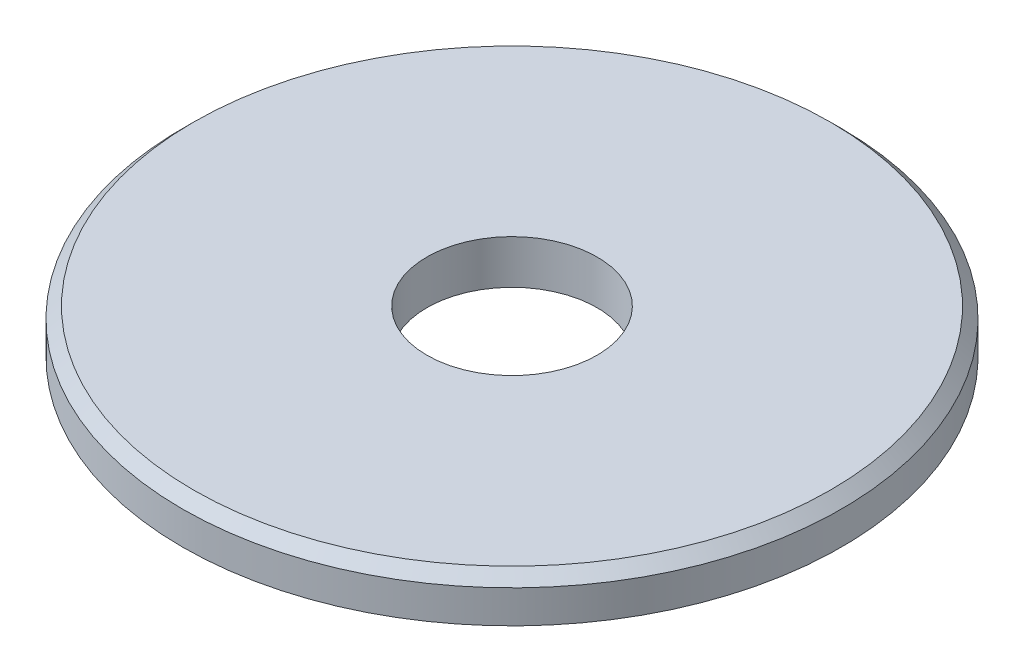
ISO-10303-21;
HEADER;
FILE_DESCRIPTION(('STEP AP214'),'2;1');
FILE_NAME('part.step','',(''),(''),'','','');
FILE_SCHEMA(('AUTOMOTIVE_DESIGN { 1 0 10303 214 1 1 1 1 }'));
ENDSEC;
DATA;
#1=APPLICATION_CONTEXT('core data for automotive mechanical design processes');
#2=APPLICATION_PROTOCOL_DEFINITION('international standard','automotive_design',2000,#1);
#3=PRODUCT_CONTEXT('',#1,'mechanical');
#4=PRODUCT('Part','Part','',(#3));
#5=PRODUCT_RELATED_PRODUCT_CATEGORY('part','',(#4));
#6=PRODUCT_DEFINITION_FORMATION('','',#4);
#7=PRODUCT_DEFINITION_CONTEXT('part definition',#1,'design');
#8=PRODUCT_DEFINITION('design','',#6,#7);
#9=PRODUCT_DEFINITION_SHAPE('','',#8);
#10=(LENGTH_UNIT() NAMED_UNIT(*) SI_UNIT(.MILLI.,.METRE.));
#11=(NAMED_UNIT(*) PLANE_ANGLE_UNIT() SI_UNIT($,.RADIAN.));
#12=(NAMED_UNIT(*) SI_UNIT($,.STERADIAN.) SOLID_ANGLE_UNIT());
#13=UNCERTAINTY_MEASURE_WITH_UNIT(LENGTH_MEASURE(1.E-05),#10,'distance_accuracy_value','');
#14=(GEOMETRIC_REPRESENTATION_CONTEXT(3) GLOBAL_UNCERTAINTY_ASSIGNED_CONTEXT((#13)) GLOBAL_UNIT_ASSIGNED_CONTEXT((#10,
#11,#12)) REPRESENTATION_CONTEXT('',''));
#15=CARTESIAN_POINT('',(0.,0.,0.));
#16=DIRECTION('',(0.,0.,1.));
#17=DIRECTION('',(1.,0.,0.));
#18=AXIS2_PLACEMENT_3D('',#15,#16,#17);
#19=CARTESIAN_POINT('',(0.,0.8,0.));
#20=DIRECTION('',(0.,1.,0.));
#21=DIRECTION('',(0.,0.,1.));
#22=AXIS2_PLACEMENT_3D('',#19,#20,#21);
#23=PLANE('',#22);
#24=CARTESIAN_POINT('',(0.,0.8,0.));
#25=DIRECTION('',(0.,1.,0.));
#26=DIRECTION('',(0.,0.,1.));
#27=AXIS2_PLACEMENT_3D('',#24,#25,#26);
#28=CIRCLE('',#27,5.8);
#29=CARTESIAN_POINT('',(0.,0.8,5.8));
#30=VERTEX_POINT('',#29);
#31=EDGE_CURVE('E40',#30,#30,#28,.T.);
#32=ORIENTED_EDGE('',*,*,#31,.T.);
#33=EDGE_LOOP('',(#32));
#34=FACE_BOUND('',#33,.T.);
#35=CARTESIAN_POINT('',(0.,0.8,0.));
#36=DIRECTION('',(0.,1.,0.));
#37=DIRECTION('',(0.,0.,1.));
#38=AXIS2_PLACEMENT_3D('',#35,#36,#37);
#39=CIRCLE('',#38,1.55);
#40=CARTESIAN_POINT('',(0.,0.8,1.55));
#41=VERTEX_POINT('',#40);
#42=EDGE_CURVE('E48',#41,#41,#39,.T.);
#43=ORIENTED_EDGE('',*,*,#42,.F.);
#44=EDGE_LOOP('',(#43));
#45=FACE_BOUND('',#44,.T.);
#46=ADVANCED_FACE('F33',(#34,#45),#23,.T.);
#47=CARTESIAN_POINT('',(0.,0.,0.));
#48=DIRECTION('',(0.,1.,0.));
#49=DIRECTION('',(0.,0.,1.));
#50=AXIS2_PLACEMENT_3D('',#47,#48,#49);
#51=PLANE('',#50);
#52=CARTESIAN_POINT('',(0.,0.,0.));
#53=DIRECTION('',(0.,1.,0.));
#54=DIRECTION('',(0.,0.,1.));
#55=AXIS2_PLACEMENT_3D('',#52,#53,#54);
#56=CIRCLE('',#55,6.);
#57=CARTESIAN_POINT('',(0.,0.,6.));
#58=VERTEX_POINT('',#57);
#59=EDGE_CURVE('E44',#58,#58,#56,.T.);
#60=ORIENTED_EDGE('',*,*,#59,.F.);
#61=EDGE_LOOP('',(#60));
#62=FACE_BOUND('',#61,.T.);
#63=CARTESIAN_POINT('',(0.,0.,0.));
#64=DIRECTION('',(0.,1.,0.));
#65=DIRECTION('',(0.,0.,1.));
#66=AXIS2_PLACEMENT_3D('',#63,#64,#65);
#67=CIRCLE('',#66,1.55);
#68=CARTESIAN_POINT('',(0.,0.,1.55));
#69=VERTEX_POINT('',#68);
#70=EDGE_CURVE('E51',#69,#69,#67,.T.);
#71=ORIENTED_EDGE('',*,*,#70,.T.);
#72=EDGE_LOOP('',(#71));
#73=FACE_BOUND('',#72,.T.);
#74=ADVANCED_FACE('F61',(#62,#73),#51,.F.);
#75=CARTESIAN_POINT('',(0.,0.8,0.));
#76=DIRECTION('',(0.,-1.,0.));
#77=DIRECTION('',(0.,0.,-1.));
#78=AXIS2_PLACEMENT_3D('',#75,#76,#77);
#79=CYLINDRICAL_SURFACE('',#78,6.);
#80=CARTESIAN_POINT('',(0.,0.599999999999996,0.));
#81=DIRECTION('',(0.,1.,0.));
#82=DIRECTION('',(0.,0.,1.));
#83=AXIS2_PLACEMENT_3D('',#80,#81,#82);
#84=CIRCLE('',#83,6.);
#85=CARTESIAN_POINT('',(0.,0.599999999999996,6.));
#86=VERTEX_POINT('',#85);
#87=EDGE_CURVE('E10',#86,#86,#84,.F.);
#88=ORIENTED_EDGE('',*,*,#87,.T.);
#89=EDGE_LOOP('',(#88));
#90=FACE_BOUND('',#89,.T.);
#91=ORIENTED_EDGE('',*,*,#59,.T.);
#92=EDGE_LOOP('',(#91));
#93=FACE_BOUND('',#92,.T.);
#94=ADVANCED_FACE('F66',(#90,#93),#79,.T.);
#95=CARTESIAN_POINT('',(0.,0.8,0.));
#96=DIRECTION('',(0.,-1.,0.));
#97=DIRECTION('',(0.,0.,-1.));
#98=AXIS2_PLACEMENT_3D('',#95,#96,#97);
#99=CYLINDRICAL_SURFACE('',#98,1.55);
#100=ORIENTED_EDGE('',*,*,#42,.T.);
#101=EDGE_LOOP('',(#100));
#102=FACE_BOUND('',#101,.T.);
#103=ORIENTED_EDGE('',*,*,#70,.F.);
#104=EDGE_LOOP('',(#103));
#105=FACE_BOUND('',#104,.T.);
#106=ADVANCED_FACE('F57',(#102,#105),#99,.F.);
#107=CARTESIAN_POINT('',(0.,0.8,0.));
#108=DIRECTION('',(0.,-1.,0.));
#109=DIRECTION('',(0.,0.,-1.));
#110=AXIS2_PLACEMENT_3D('',#107,#108,#109);
#111=CONICAL_SURFACE('',#110,5.8,0.785398163397446);
#112=ORIENTED_EDGE('',*,*,#87,.F.);
#113=EDGE_LOOP('',(#112));
#114=FACE_BOUND('',#113,.T.);
#115=ORIENTED_EDGE('',*,*,#31,.F.);
#116=EDGE_LOOP('',(#115));
#117=FACE_BOUND('',#116,.T.);
#118=ADVANCED_FACE('F35',(#114,#117),#111,.T.);
#119=CLOSED_SHELL('',(#46,#74,#94,#106,#118));
#120=MANIFOLD_SOLID_BREP('B2',#119);
#121=ADVANCED_BREP_SHAPE_REPRESENTATION('',(#18,#120),#14);
#122=SHAPE_DEFINITION_REPRESENTATION(#9,#121);
ENDSEC;
END-ISO-10303-21;
